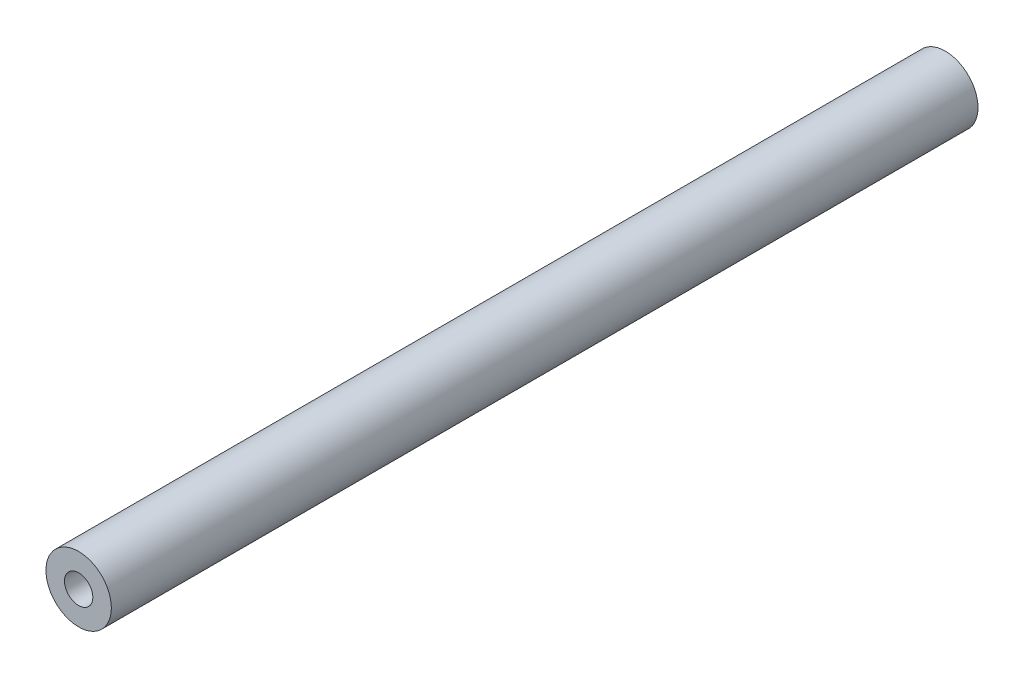
ISO-10303-21;
HEADER;
FILE_DESCRIPTION(('STEP AP214'),'2;1');
FILE_NAME('part.step','',(''),(''),'','','');
FILE_SCHEMA(('AUTOMOTIVE_DESIGN { 1 0 10303 214 1 1 1 1 }'));
ENDSEC;
DATA;
#1=APPLICATION_CONTEXT('core data for automotive mechanical design processes');
#2=APPLICATION_PROTOCOL_DEFINITION('international standard','automotive_design',2000,#1);
#3=PRODUCT_CONTEXT('',#1,'mechanical');
#4=PRODUCT('Part','Part','',(#3));
#5=PRODUCT_RELATED_PRODUCT_CATEGORY('part','',(#4));
#6=PRODUCT_DEFINITION_FORMATION('','',#4);
#7=PRODUCT_DEFINITION_CONTEXT('part definition',#1,'design');
#8=PRODUCT_DEFINITION('design','',#6,#7);
#9=PRODUCT_DEFINITION_SHAPE('','',#8);
#10=(LENGTH_UNIT() NAMED_UNIT(*) SI_UNIT(.MILLI.,.METRE.));
#11=(NAMED_UNIT(*) PLANE_ANGLE_UNIT() SI_UNIT($,.RADIAN.));
#12=(NAMED_UNIT(*) SI_UNIT($,.STERADIAN.) SOLID_ANGLE_UNIT());
#13=UNCERTAINTY_MEASURE_WITH_UNIT(LENGTH_MEASURE(1.E-05),#10,'distance_accuracy_value','');
#14=(GEOMETRIC_REPRESENTATION_CONTEXT(3) GLOBAL_UNCERTAINTY_ASSIGNED_CONTEXT((#13)) GLOBAL_UNIT_ASSIGNED_CONTEXT((#10,
#11,#12)) REPRESENTATION_CONTEXT('',''));
#15=CARTESIAN_POINT('',(0.,0.,0.));
#16=DIRECTION('',(0.,0.,1.));
#17=DIRECTION('',(1.,0.,0.));
#18=AXIS2_PLACEMENT_3D('',#15,#16,#17);
#19=CARTESIAN_POINT('',(-0.694032771342668,-5.95972470104974,-59.));
#20=DIRECTION('',(0.,0.,-1.));
#21=DIRECTION('',(0.115672128557112,0.993287450174957,0.));
#22=AXIS2_PLACEMENT_3D('',#19,#20,#21);
#23=PLANE('',#22);
#24=CARTESIAN_POINT('',(0.,0.,-59.));
#25=DIRECTION('',(0.,0.,-1.));
#26=DIRECTION('',(-1.,0.,0.));
#27=AXIS2_PLACEMENT_3D('',#24,#25,#26);
#28=CIRCLE('',#27,2.59999999999999);
#29=CARTESIAN_POINT('',(-2.59999999999999,0.,-59.));
#30=VERTEX_POINT('',#29);
#31=EDGE_CURVE('E64',#30,#30,#28,.T.);
#32=ORIENTED_EDGE('',*,*,#31,.F.);
#33=EDGE_LOOP('',(#32));
#34=FACE_BOUND('',#33,.T.);
#35=CARTESIAN_POINT('',(0.,0.,-59.));
#36=DIRECTION('',(0.,0.,-1.));
#37=DIRECTION('',(-1.,0.,0.));
#38=AXIS2_PLACEMENT_3D('',#35,#36,#37);
#39=CIRCLE('',#38,6.);
#40=CARTESIAN_POINT('',(-6.,0.,-59.));
#41=VERTEX_POINT('',#40);
#42=EDGE_CURVE('E11',#41,#41,#39,.F.);
#43=ORIENTED_EDGE('',*,*,#42,.F.);
#44=EDGE_LOOP('',(#43));
#45=FACE_BOUND('',#44,.T.);
#46=ADVANCED_FACE('F38',(#34,#45),#23,.T.);
#47=CARTESIAN_POINT('',(0.,0.,-77.9705627484771));
#48=DIRECTION('',(0.,0.,1.));
#49=DIRECTION('',(1.,0.,0.));
#50=AXIS2_PLACEMENT_3D('',#47,#48,#49);
#51=CYLINDRICAL_SURFACE('',#50,6.);
#52=ORIENTED_EDGE('',*,*,#42,.T.);
#53=EDGE_LOOP('',(#52));
#54=FACE_BOUND('',#53,.T.);
#55=CARTESIAN_POINT('',(0.,0.,100.));
#56=DIRECTION('',(0.,0.,1.));
#57=DIRECTION('',(1.,0.,0.));
#58=AXIS2_PLACEMENT_3D('',#55,#56,#57);
#59=CIRCLE('',#58,6.);
#60=CARTESIAN_POINT('',(6.,0.,100.));
#61=VERTEX_POINT('',#60);
#62=EDGE_CURVE('E46',#61,#61,#59,.T.);
#63=ORIENTED_EDGE('',*,*,#62,.F.);
#64=EDGE_LOOP('',(#63));
#65=FACE_BOUND('',#64,.T.);
#66=ADVANCED_FACE('F84',(#54,#65),#51,.T.);
#67=CARTESIAN_POINT('',(0.,0.,100.));
#68=DIRECTION('',(0.,0.,1.));
#69=DIRECTION('',(1.,0.,0.));
#70=AXIS2_PLACEMENT_3D('',#67,#68,#69);
#71=PLANE('',#70);
#72=CARTESIAN_POINT('',(0.,0.,100.));
#73=DIRECTION('',(0.,0.,1.));
#74=DIRECTION('',(1.,0.,0.));
#75=AXIS2_PLACEMENT_3D('',#72,#73,#74);
#76=CIRCLE('',#75,2.59999999999999);
#77=CARTESIAN_POINT('',(2.59999999999999,0.,100.));
#78=VERTEX_POINT('',#77);
#79=EDGE_CURVE('E63',#78,#78,#76,.T.);
#80=ORIENTED_EDGE('',*,*,#79,.F.);
#81=EDGE_LOOP('',(#80));
#82=FACE_BOUND('',#81,.T.);
#83=ORIENTED_EDGE('',*,*,#62,.T.);
#84=EDGE_LOOP('',(#83));
#85=FACE_BOUND('',#84,.T.);
#86=ADVANCED_FACE('F82',(#82,#85),#71,.T.);
#87=CARTESIAN_POINT('',(0.,0.,70.));
#88=DIRECTION('',(0.,0.,1.));
#89=DIRECTION('',(1.,0.,0.));
#90=AXIS2_PLACEMENT_3D('',#87,#88,#89);
#91=CONICAL_SURFACE('',#90,2.59999999999996,1.02974425867664);
#92=CARTESIAN_POINT('',(0.,0.,68.4377623905283));
#93=VERTEX_POINT('',#92);
#94=VERTEX_LOOP('',#93);
#95=FACE_BOUND('',#94,.T.);
#96=CARTESIAN_POINT('',(0.,0.,70.));
#97=DIRECTION('',(0.,0.,1.));
#98=DIRECTION('',(1.,0.,0.));
#99=AXIS2_PLACEMENT_3D('',#96,#97,#98);
#100=CIRCLE('',#99,2.59999999999996);
#101=CARTESIAN_POINT('',(2.59999999999996,0.,70.));
#102=VERTEX_POINT('',#101);
#103=EDGE_CURVE('E70',#102,#102,#100,.T.);
#104=ORIENTED_EDGE('',*,*,#103,.T.);
#105=EDGE_LOOP('',(#104));
#106=FACE_BOUND('',#105,.T.);
#107=ADVANCED_FACE('F91',(#95,#106),#91,.F.);
#108=CARTESIAN_POINT('',(0.,0.,100.));
#109=DIRECTION('',(0.,0.,1.));
#110=DIRECTION('',(1.,0.,0.));
#111=AXIS2_PLACEMENT_3D('',#108,#109,#110);
#112=CYLINDRICAL_SURFACE('',#111,2.59999999999997);
#113=ORIENTED_EDGE('',*,*,#103,.F.);
#114=EDGE_LOOP('',(#113));
#115=FACE_BOUND('',#114,.T.);
#116=ORIENTED_EDGE('',*,*,#79,.T.);
#117=EDGE_LOOP('',(#116));
#118=FACE_BOUND('',#117,.T.);
#119=ADVANCED_FACE('F56',(#115,#118),#112,.F.);
#120=CARTESIAN_POINT('',(0.,0.,-29.));
#121=DIRECTION('',(0.,0.,-1.));
#122=DIRECTION('',(-1.,0.,0.));
#123=AXIS2_PLACEMENT_3D('',#120,#121,#122);
#124=CONICAL_SURFACE('',#123,2.59999999999999,1.02974425867665);
#125=CARTESIAN_POINT('',(0.,0.,-27.4377623905283));
#126=VERTEX_POINT('',#125);
#127=VERTEX_LOOP('',#126);
#128=FACE_BOUND('',#127,.T.);
#129=CARTESIAN_POINT('',(0.,0.,-29.));
#130=DIRECTION('',(0.,0.,-1.));
#131=DIRECTION('',(-1.,0.,0.));
#132=AXIS2_PLACEMENT_3D('',#129,#130,#131);
#133=CIRCLE('',#132,2.59999999999999);
#134=CARTESIAN_POINT('',(-2.59999999999999,0.,-29.));
#135=VERTEX_POINT('',#134);
#136=EDGE_CURVE('E60',#135,#135,#133,.T.);
#137=ORIENTED_EDGE('',*,*,#136,.T.);
#138=EDGE_LOOP('',(#137));
#139=FACE_BOUND('',#138,.T.);
#140=ADVANCED_FACE('F52',(#128,#139),#124,.F.);
#141=CARTESIAN_POINT('',(0.,0.,-59.));
#142=DIRECTION('',(0.,0.,-1.));
#143=DIRECTION('',(-1.,0.,0.));
#144=AXIS2_PLACEMENT_3D('',#141,#142,#143);
#145=CYLINDRICAL_SURFACE('',#144,2.59999999999999);
#146=ORIENTED_EDGE('',*,*,#136,.F.);
#147=EDGE_LOOP('',(#146));
#148=FACE_BOUND('',#147,.T.);
#149=ORIENTED_EDGE('',*,*,#31,.T.);
#150=EDGE_LOOP('',(#149));
#151=FACE_BOUND('',#150,.T.);
#152=ADVANCED_FACE('F55',(#148,#151),#145,.F.);
#153=CLOSED_SHELL('',(#46,#66,#86,#107,#119,#140,#152));
#154=MANIFOLD_SOLID_BREP('B2',#153);
#155=ADVANCED_BREP_SHAPE_REPRESENTATION('',(#18,#154),#14);
#156=SHAPE_DEFINITION_REPRESENTATION(#9,#155);
ENDSEC;
END-ISO-10303-21;
